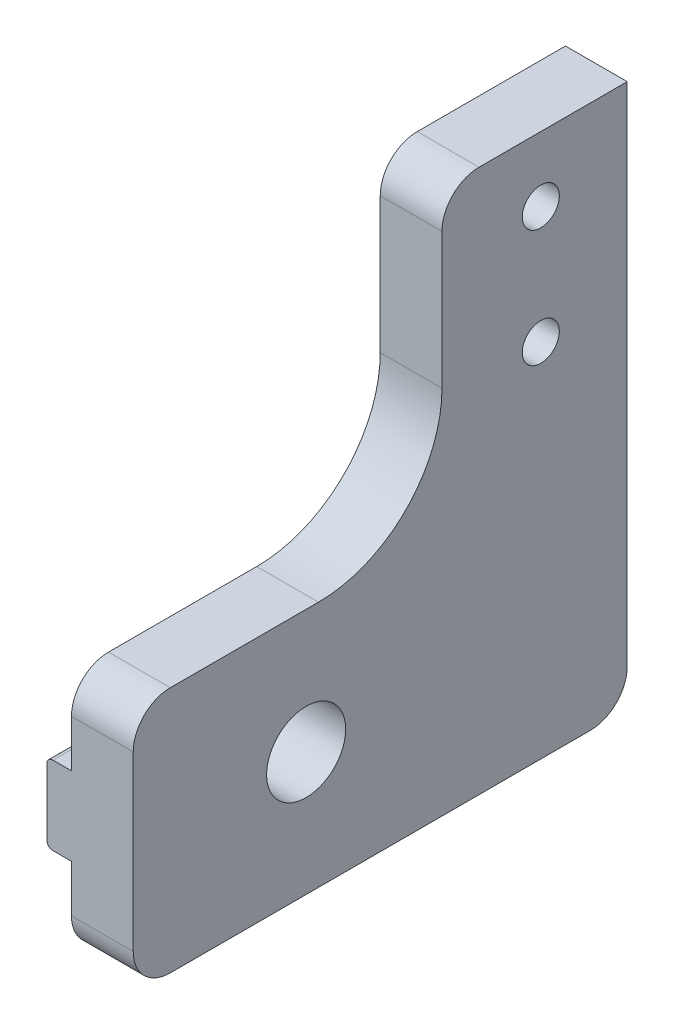
ISO-10303-21;
HEADER;
FILE_DESCRIPTION(('STEP AP214'),'2;1');
FILE_NAME('part.step','',(''),(''),'','','');
FILE_SCHEMA(('AUTOMOTIVE_DESIGN { 1 0 10303 214 1 1 1 1 }'));
ENDSEC;
DATA;
#1=APPLICATION_CONTEXT('core data for automotive mechanical design processes');
#2=APPLICATION_PROTOCOL_DEFINITION('international standard','automotive_design',2000,#1);
#3=PRODUCT_CONTEXT('',#1,'mechanical');
#4=PRODUCT('Part','Part','',(#3));
#5=PRODUCT_RELATED_PRODUCT_CATEGORY('part','',(#4));
#6=PRODUCT_DEFINITION_FORMATION('','',#4);
#7=PRODUCT_DEFINITION_CONTEXT('part definition',#1,'design');
#8=PRODUCT_DEFINITION('design','',#6,#7);
#9=PRODUCT_DEFINITION_SHAPE('','',#8);
#10=(LENGTH_UNIT() NAMED_UNIT(*) SI_UNIT(.MILLI.,.METRE.));
#11=(NAMED_UNIT(*) PLANE_ANGLE_UNIT() SI_UNIT($,.RADIAN.));
#12=(NAMED_UNIT(*) SI_UNIT($,.STERADIAN.) SOLID_ANGLE_UNIT());
#13=UNCERTAINTY_MEASURE_WITH_UNIT(LENGTH_MEASURE(1.E-05),#10,'distance_accuracy_value','');
#14=(GEOMETRIC_REPRESENTATION_CONTEXT(3) GLOBAL_UNCERTAINTY_ASSIGNED_CONTEXT((#13)) GLOBAL_UNIT_ASSIGNED_CONTEXT((#10,
#11,#12)) REPRESENTATION_CONTEXT('',''));
#15=CARTESIAN_POINT('',(0.,0.,0.));
#16=DIRECTION('',(0.,0.,1.));
#17=DIRECTION('',(1.,0.,0.));
#18=AXIS2_PLACEMENT_3D('',#15,#16,#17);
#19=CARTESIAN_POINT('',(-2.,6.825,-40.));
#20=DIRECTION('',(0.,1.,0.));
#21=DIRECTION('',(0.,0.,1.));
#22=AXIS2_PLACEMENT_3D('',#19,#20,#21);
#23=PLANE('',#22);
#24=DIRECTION('',(0.,0.,1.));
#25=VECTOR('',#24,1.);
#26=CARTESIAN_POINT('',(-1.5,6.825,-40.));
#27=LINE('',#26,#25);
#28=CARTESIAN_POINT('',(-1.5,6.825,0.));
#29=VERTEX_POINT('',#28);
#30=CARTESIAN_POINT('',(-1.5,6.825,-13.597588320249));
#31=VERTEX_POINT('',#30);
#32=EDGE_CURVE('E236',#29,#31,#27,.F.);
#33=ORIENTED_EDGE('',*,*,#32,.T.);
#34=DIRECTION('',(1.,0.,0.));
#35=VECTOR('',#34,1.);
#36=CARTESIAN_POINT('',(-2.,6.825,-13.597588320249));
#37=LINE('',#36,#35);
#38=CARTESIAN_POINT('',(0.,6.825,-13.597588320249));
#39=VERTEX_POINT('',#38);
#40=EDGE_CURVE('E335',#31,#39,#37,.T.);
#41=ORIENTED_EDGE('',*,*,#40,.T.);
#42=DIRECTION('',(0.,0.,1.));
#43=VECTOR('',#42,1.);
#44=CARTESIAN_POINT('',(0.,6.825,-40.));
#45=LINE('',#44,#43);
#46=CARTESIAN_POINT('',(0.,6.825,0.));
#47=VERTEX_POINT('',#46);
#48=EDGE_CURVE('E334',#39,#47,#45,.T.);
#49=ORIENTED_EDGE('',*,*,#48,.T.);
#50=DIRECTION('',(1.,0.,0.));
#51=VECTOR('',#50,1.);
#52=CARTESIAN_POINT('',(-2.,6.825,0.));
#53=LINE('',#52,#51);
#54=EDGE_CURVE('E354',#29,#47,#53,.T.);
#55=ORIENTED_EDGE('',*,*,#54,.F.);
#56=EDGE_LOOP('',(#33,#41,#49,#55));
#57=FACE_BOUND('',#56,.T.);
#58=ADVANCED_FACE('F37',(#57),#23,.F.);
#59=CARTESIAN_POINT('',(-2.,13.175,-40.));
#60=DIRECTION('',(0.,-1.,0.));
#61=DIRECTION('',(0.,0.,-1.));
#62=AXIS2_PLACEMENT_3D('',#59,#60,#61);
#63=PLANE('',#62);
#64=DIRECTION('',(0.,0.,-1.));
#65=VECTOR('',#64,1.);
#66=CARTESIAN_POINT('',(-1.5,13.175,-40.));
#67=LINE('',#66,#65);
#68=CARTESIAN_POINT('',(-1.5,13.175,-40.));
#69=VERTEX_POINT('',#68);
#70=CARTESIAN_POINT('',(-1.5,13.175,-14.402411679751));
#71=VERTEX_POINT('',#70);
#72=EDGE_CURVE('E243',#69,#71,#67,.F.);
#73=ORIENTED_EDGE('',*,*,#72,.T.);
#74=DIRECTION('',(1.,0.,0.));
#75=VECTOR('',#74,1.);
#76=CARTESIAN_POINT('',(-2.,13.175,-14.402411679751));
#77=LINE('',#76,#75);
#78=CARTESIAN_POINT('',(0.,13.175,-14.402411679751));
#79=VERTEX_POINT('',#78);
#80=EDGE_CURVE('E198',#71,#79,#77,.T.);
#81=ORIENTED_EDGE('',*,*,#80,.T.);
#82=DIRECTION('',(0.,0.,-1.));
#83=VECTOR('',#82,1.);
#84=CARTESIAN_POINT('',(0.,13.175,-40.));
#85=LINE('',#84,#83);
#86=CARTESIAN_POINT('',(0.,13.175,-40.));
#87=VERTEX_POINT('',#86);
#88=EDGE_CURVE('E346',#79,#87,#85,.T.);
#89=ORIENTED_EDGE('',*,*,#88,.T.);
#90=DIRECTION('',(1.,0.,0.));
#91=VECTOR('',#90,1.);
#92=CARTESIAN_POINT('',(-2.,13.175,-40.));
#93=LINE('',#92,#91);
#94=EDGE_CURVE('E342',#69,#87,#93,.T.);
#95=ORIENTED_EDGE('',*,*,#94,.F.);
#96=EDGE_LOOP('',(#73,#81,#89,#95));
#97=FACE_BOUND('',#96,.T.);
#98=ADVANCED_FACE('F449',(#97),#63,.F.);
#99=CARTESIAN_POINT('',(-2.,0.,0.));
#100=DIRECTION('',(1.,0.,0.));
#101=DIRECTION('',(0.,0.,-1.));
#102=AXIS2_PLACEMENT_3D('',#99,#100,#101);
#103=PLANE('',#102);
#104=DIRECTION('',(0.,0.,-1.));
#105=VECTOR('',#104,1.);
#106=CARTESIAN_POINT('',(-2.,12.675,0.));
#107=LINE('',#106,#105);
#108=CARTESIAN_POINT('',(-2.,12.675,0.));
#109=VERTEX_POINT('',#108);
#110=CARTESIAN_POINT('',(-2.,12.675,-12.2430323964284));
#111=VERTEX_POINT('',#110);
#112=EDGE_CURVE('E220',#109,#111,#107,.T.);
#113=ORIENTED_EDGE('',*,*,#112,.T.);
#114=CARTESIAN_POINT('',(-2.,10.,-14.));
#115=DIRECTION('',(1.,0.,0.));
#116=DIRECTION('',(0.,0.,-1.));
#117=AXIS2_PLACEMENT_3D('',#114,#115,#116);
#118=CIRCLE('',#117,3.2004);
#119=CARTESIAN_POINT('',(-2.,7.325,-12.2430323964284));
#120=VERTEX_POINT('',#119);
#121=EDGE_CURVE('E214',#111,#120,#118,.T.);
#122=ORIENTED_EDGE('',*,*,#121,.T.);
#123=DIRECTION('',(0.,0.,1.));
#124=VECTOR('',#123,1.);
#125=CARTESIAN_POINT('',(-2.,7.325,0.));
#126=LINE('',#125,#124);
#127=CARTESIAN_POINT('',(-2.,7.325,0.));
#128=VERTEX_POINT('',#127);
#129=EDGE_CURVE('E224',#120,#128,#126,.T.);
#130=ORIENTED_EDGE('',*,*,#129,.T.);
#131=DIRECTION('',(0.,1.,0.));
#132=VECTOR('',#131,1.);
#133=CARTESIAN_POINT('',(-2.,6.825,0.));
#134=LINE('',#133,#132);
#135=EDGE_CURVE('E338',#128,#109,#134,.T.);
#136=ORIENTED_EDGE('',*,*,#135,.T.);
#137=EDGE_LOOP('',(#113,#122,#130,#136));
#138=FACE_BOUND('',#137,.T.);
#139=ADVANCED_FACE('F479',(#138),#103,.F.);
#140=CARTESIAN_POINT('',(-1.5,7.325,0.));
#141=DIRECTION('',(0.,0.,1.));
#142=DIRECTION('',(0.,-1.,0.));
#143=AXIS2_PLACEMENT_3D('',#140,#141,#142);
#144=CYLINDRICAL_SURFACE('',#143,0.5);
#145=CARTESIAN_POINT('',(-1.5,6.825,-13.597588320249));
#146=CARTESIAN_POINT('',(-1.50427664191402,6.82499814053139,-13.5976049597973));
#147=CARTESIAN_POINT('',(-1.50852658700402,6.82505476239598,-13.5971560866422));
#148=CARTESIAN_POINT('',(-1.51679500239354,6.82526586793275,-13.5954948382761));
#149=CARTESIAN_POINT('',(-1.52081628697154,6.82541853972414,-13.5942966014562));
#150=CARTESIAN_POINT('',(-1.52995260437398,6.82587003464056,-13.5907776491562));
#151=CARTESIAN_POINT('',(-1.53496878522544,6.82620104849179,-13.5882127316332));
#152=CARTESIAN_POINT('',(-1.54457707865009,6.82696774443779,-13.5823451196413));
#153=CARTESIAN_POINT('',(-1.54916522864581,6.82740429143693,-13.579036345411));
#154=CARTESIAN_POINT('',(-1.56530407860007,6.82914003196233,-13.5660703252987));
#155=CARTESIAN_POINT('',(-1.5756895717888,6.8306625889816,-13.5550371577924));
#156=CARTESIAN_POINT('',(-1.59497632086415,6.83400847216192,-13.5318100903644));
#157=CARTESIAN_POINT('',(-1.60386810122129,6.83583358253153,-13.5196094980821));
#158=CARTESIAN_POINT('',(-1.63096049207533,6.8420698598244,-13.4796124920958));
#159=CARTESIAN_POINT('',(-1.64746332067128,6.84694654550404,-13.4507430474807));
#160=CARTESIAN_POINT('',(-1.67859760121378,6.85770472544215,-13.3921808481114));
#161=CARTESIAN_POINT('',(-1.69322351906558,6.86358907689914,-13.3624859591236));
#162=CARTESIAN_POINT('',(-1.72124956622155,6.876349349685,-13.3026471084432));
#163=CARTESIAN_POINT('',(-1.7346472498042,6.88322718206305,-13.2725023840206));
#164=CARTESIAN_POINT('',(-1.76047271962536,6.89794819834407,-13.2120897546067));
#165=CARTESIAN_POINT('',(-1.77290169292587,6.905790169402,-13.1818220497651));
#166=CARTESIAN_POINT('',(-1.80908226307331,6.93087327135872,-13.0905993667109));
#167=CARTESIAN_POINT('',(-1.83158226871623,6.94960391800914,-13.0295454297643));
#168=CARTESIAN_POINT('',(-1.87333789944561,6.99110943341728,-12.907620120899));
#169=CARTESIAN_POINT('',(-1.89258982470967,7.01388885423065,-12.8467490337195));
#170=CARTESIAN_POINT('',(-1.92717787078553,7.06341493508024,-12.725925199187));
#171=CARTESIAN_POINT('',(-1.94253554406723,7.09013840420448,-12.6659692037151));
#172=CARTESIAN_POINT('',(-1.96855570650107,7.14765687033618,-12.5470544128651));
#173=CARTESIAN_POINT('',(-1.97922454264293,7.17844628959266,-12.4880943739921));
#174=CARTESIAN_POINT('',(-1.99104279638496,7.22902789270643,-12.3982538736311));
#175=CARTESIAN_POINT('',(-1.99431439978301,7.24741453586647,-12.3668562023655));
#176=CARTESIAN_POINT('',(-1.99878999296379,7.28535209819371,-12.3045404901));
#177=CARTESIAN_POINT('',(-1.99998991453283,7.30490523034714,-12.2736235106976));
#178=CARTESIAN_POINT('',(-2.,7.325,-12.2430323964284));
#179=B_SPLINE_CURVE_WITH_KNOTS('',3,(#145,#146,#147,#148,#149,#150,#151,#152,#153,#154,#155,
#156,#157,#158,#159,#160,#161,#162,#163,#164,#165,#166,#167,#168,#169,#170,#171,#172,#173,#174,
#175,#176,#177,#178),.UNSPECIFIED.,.F.,.F.,(4,2,2,2,2,2,2,2,2,2,2,2,2,2,2,2,4),(0.,
0.0127634346770811,0.0252930369842646,0.0421271138064015,0.0591041341208309,0.104426226618348,
0.150025775116456,0.250587203769936,0.351438640484329,0.452486723255077,0.55340896808811,
0.756325943303772,0.959472519028141,1.16146896849709,1.36319113926759,1.47271524417688,
1.58245418073128),.UNSPECIFIED.);
#180=EDGE_CURVE('E327',#31,#120,#179,.T.);
#181=ORIENTED_EDGE('',*,*,#180,.F.);
#182=ORIENTED_EDGE('',*,*,#32,.F.);
#183=CARTESIAN_POINT('',(-1.5,7.325,0.));
#184=DIRECTION('',(0.,0.,-1.));
#185=DIRECTION('',(-1.,0.,0.));
#186=AXIS2_PLACEMENT_3D('',#183,#184,#185);
#187=CIRCLE('',#186,0.5);
#188=EDGE_CURVE('E233',#128,#29,#187,.F.);
#189=ORIENTED_EDGE('',*,*,#188,.F.);
#190=ORIENTED_EDGE('',*,*,#129,.F.);
#191=EDGE_LOOP('',(#181,#182,#189,#190));
#192=FACE_BOUND('',#191,.T.);
#193=ADVANCED_FACE('F323',(#192),#144,.T.);
#194=CARTESIAN_POINT('',(-1.5,12.675,0.));
#195=DIRECTION('',(0.,0.,-1.));
#196=DIRECTION('',(-1.,0.,0.));
#197=AXIS2_PLACEMENT_3D('',#194,#195,#196);
#198=CYLINDRICAL_SURFACE('',#197,0.5);
#199=CARTESIAN_POINT('',(-1.5,13.175,-14.402411679751));
#200=CARTESIAN_POINT('',(-1.50427664191402,13.1750018594686,-14.4023950402028));
#201=CARTESIAN_POINT('',(-1.50852658700402,13.174945237604,-14.4028439133578));
#202=CARTESIAN_POINT('',(-1.51679500239354,13.1747341320672,-14.4045051617239));
#203=CARTESIAN_POINT('',(-1.52081628697154,13.1745814602759,-14.4057033985438));
#204=CARTESIAN_POINT('',(-1.52995260437398,13.1741299653594,-14.4092223508438));
#205=CARTESIAN_POINT('',(-1.53496878522544,13.1737989515082,-14.4117872683668));
#206=CARTESIAN_POINT('',(-1.54457707865009,13.1730322555622,-14.4176548803587));
#207=CARTESIAN_POINT('',(-1.54916522864581,13.1725957085631,-14.420963654589));
#208=CARTESIAN_POINT('',(-1.56530407860007,13.1708599680377,-14.4339296747013));
#209=CARTESIAN_POINT('',(-1.5756895717888,13.1693374110184,-14.4449628422076));
#210=CARTESIAN_POINT('',(-1.59497632086415,13.1659915278381,-14.4681899096356));
#211=CARTESIAN_POINT('',(-1.6038681012213,13.1641664174685,-14.4803905019179));
#212=CARTESIAN_POINT('',(-1.63096049207534,13.1579301401756,-14.5203875079042));
#213=CARTESIAN_POINT('',(-1.64746332067129,13.153053454496,-14.5492569525193));
#214=CARTESIAN_POINT('',(-1.67859760121379,13.1422952745579,-14.6078191518886));
#215=CARTESIAN_POINT('',(-1.69322351906559,13.1364109231009,-14.6375140408764));
#216=CARTESIAN_POINT('',(-1.72124956622156,13.123650650315,-14.6973528915568));
#217=CARTESIAN_POINT('',(-1.73464724980421,13.1167728179369,-14.7274976159794));
#218=CARTESIAN_POINT('',(-1.76047271962537,13.1020518016559,-14.7879102453933));
#219=CARTESIAN_POINT('',(-1.77290169292588,13.094209830598,-14.818177950235));
#220=CARTESIAN_POINT('',(-1.80908226307332,13.0691267286413,-14.9094006332891));
#221=CARTESIAN_POINT('',(-1.83158226871624,13.0503960819908,-14.9704545702358));
#222=CARTESIAN_POINT('',(-1.87333789944562,13.0088905665827,-15.0923798791011));
#223=CARTESIAN_POINT('',(-1.89258982470968,12.9861111457693,-15.1532509662806));
#224=CARTESIAN_POINT('',(-1.92717787078554,12.9365850649197,-15.2740748008131));
#225=CARTESIAN_POINT('',(-1.94253554406725,12.9098615957955,-15.3340307962849));
#226=CARTESIAN_POINT('',(-1.96855570650108,12.8523431296638,-15.4529455871349));
#227=CARTESIAN_POINT('',(-1.97922454264294,12.8215537104073,-15.511905626008));
#228=CARTESIAN_POINT('',(-1.99104279638496,12.7709721072935,-15.601746126369));
#229=CARTESIAN_POINT('',(-1.99431439978301,12.7525854641335,-15.6331437976345));
#230=CARTESIAN_POINT('',(-1.99878999296379,12.7146479018063,-15.6954595099));
#231=CARTESIAN_POINT('',(-1.99998991453283,12.6950947696529,-15.7263764893025));
#232=CARTESIAN_POINT('',(-2.,12.675,-15.7569676035716));
#233=B_SPLINE_CURVE_WITH_KNOTS('',3,(#199,#200,#201,#202,#203,#204,#205,#206,#207,#208,#209,
#210,#211,#212,#213,#214,#215,#216,#217,#218,#219,#220,#221,#222,#223,#224,#225,#226,#227,#228,
#229,#230,#231,#232),.UNSPECIFIED.,.F.,.F.,(4,2,2,2,2,2,2,2,2,2,2,2,2,2,2,2,4),(0.,
0.0127634346770817,0.0252930369842659,0.0421271138064035,0.0591041341208326,0.104426226618351,
0.150025775116463,0.250587203769946,0.351438640484343,0.452486723255095,0.553408968088133,
0.756325943303803,0.959472519028178,1.16146896849713,1.36319113926764,1.4727152441769,
1.58245418073126),.UNSPECIFIED.);
#234=CARTESIAN_POINT('',(-2.,12.675,-15.7569676035716));
#235=VERTEX_POINT('',#234);
#236=EDGE_CURVE('E191',#71,#235,#233,.T.);
#237=ORIENTED_EDGE('',*,*,#236,.F.);
#238=ORIENTED_EDGE('',*,*,#72,.F.);
#239=CARTESIAN_POINT('',(-1.5,12.675,-40.));
#240=DIRECTION('',(0.,0.,1.));
#241=DIRECTION('',(0.,-1.,0.));
#242=AXIS2_PLACEMENT_3D('',#239,#240,#241);
#243=CIRCLE('',#242,0.5);
#244=CARTESIAN_POINT('',(-2.,12.675,-40.));
#245=VERTEX_POINT('',#244);
#246=EDGE_CURVE('E218',#245,#69,#243,.F.);
#247=ORIENTED_EDGE('',*,*,#246,.F.);
#248=EDGE_CURVE('E210',#235,#245,#107,.T.);
#249=ORIENTED_EDGE('',*,*,#248,.F.);
#250=EDGE_LOOP('',(#237,#238,#247,#249));
#251=FACE_BOUND('',#250,.T.);
#252=ADVANCED_FACE('F217',(#251),#198,.T.);
#253=CARTESIAN_POINT('',(0.,0.,0.));
#254=DIRECTION('',(-1.,0.,0.));
#255=DIRECTION('',(0.,0.,1.));
#256=AXIS2_PLACEMENT_3D('',#253,#254,#255);
#257=PLANE('',#256);
#258=CARTESIAN_POINT('',(0.,10.,-14.));
#259=DIRECTION('',(-1.,0.,0.));
#260=DIRECTION('',(0.,0.,1.));
#261=AXIS2_PLACEMENT_3D('',#258,#259,#260);
#262=CIRCLE('',#261,3.2004);
#263=CARTESIAN_POINT('',(0.,13.175,-13.597588320249));
#264=VERTEX_POINT('',#263);
#265=EDGE_CURVE('E446',#264,#79,#262,.T.);
#266=ORIENTED_EDGE('',*,*,#265,.F.);
#267=CARTESIAN_POINT('',(0.,13.175,0.));
#268=VERTEX_POINT('',#267);
#269=EDGE_CURVE('E339',#268,#264,#85,.T.);
#270=ORIENTED_EDGE('',*,*,#269,.F.);
#271=DIRECTION('',(0.,-1.,0.));
#272=VECTOR('',#271,1.);
#273=CARTESIAN_POINT('',(0.,0.,0.));
#274=LINE('',#273,#272);
#275=CARTESIAN_POINT('',(0.,17.,0.));
#276=VERTEX_POINT('',#275);
#277=EDGE_CURVE('E377',#276,#268,#274,.T.);
#278=ORIENTED_EDGE('',*,*,#277,.F.);
#279=CARTESIAN_POINT('',(0.,17.,-3.));
#280=DIRECTION('',(-1.,0.,0.));
#281=DIRECTION('',(0.,0.,1.));
#282=AXIS2_PLACEMENT_3D('',#279,#280,#281);
#283=CIRCLE('',#282,3.);
#284=CARTESIAN_POINT('',(0.,20.,-3.));
#285=VERTEX_POINT('',#284);
#286=EDGE_CURVE('E248',#276,#285,#283,.T.);
#287=ORIENTED_EDGE('',*,*,#286,.T.);
#288=DIRECTION('',(0.,0.,1.));
#289=VECTOR('',#288,1.);
#290=CARTESIAN_POINT('',(0.,20.,0.));
#291=LINE('',#290,#289);
#292=CARTESIAN_POINT('',(0.,20.,-15.));
#293=VERTEX_POINT('',#292);
#294=EDGE_CURVE('E398',#293,#285,#291,.T.);
#295=ORIENTED_EDGE('',*,*,#294,.F.);
#296=CARTESIAN_POINT('',(0.,30.,-15.));
#297=DIRECTION('',(-1.,0.,0.));
#298=DIRECTION('',(0.,0.,1.));
#299=AXIS2_PLACEMENT_3D('',#296,#297,#298);
#300=CIRCLE('',#299,10.);
#301=CARTESIAN_POINT('',(0.,30.,-25.));
#302=VERTEX_POINT('',#301);
#303=EDGE_CURVE('E45',#293,#302,#300,.F.);
#304=ORIENTED_EDGE('',*,*,#303,.T.);
#305=DIRECTION('',(0.,-1.,0.));
#306=VECTOR('',#305,1.);
#307=CARTESIAN_POINT('',(0.,20.,-25.));
#308=LINE('',#307,#306);
#309=CARTESIAN_POINT('',(0.,41.,-25.));
#310=VERTEX_POINT('',#309);
#311=EDGE_CURVE('E396',#310,#302,#308,.T.);
#312=ORIENTED_EDGE('',*,*,#311,.F.);
#313=CARTESIAN_POINT('',(0.,41.,-28.));
#314=DIRECTION('',(-1.,0.,0.));
#315=DIRECTION('',(0.,0.,1.));
#316=AXIS2_PLACEMENT_3D('',#313,#314,#315);
#317=CIRCLE('',#316,3.);
#318=CARTESIAN_POINT('',(0.,44.,-28.));
#319=VERTEX_POINT('',#318);
#320=EDGE_CURVE('E251',#310,#319,#317,.T.);
#321=ORIENTED_EDGE('',*,*,#320,.T.);
#322=DIRECTION('',(0.,0.,1.));
#323=VECTOR('',#322,1.);
#324=CARTESIAN_POINT('',(0.,44.,-25.));
#325=LINE('',#324,#323);
#326=CARTESIAN_POINT('',(0.,44.,-40.));
#327=VERTEX_POINT('',#326);
#328=EDGE_CURVE('E393',#327,#319,#325,.T.);
#329=ORIENTED_EDGE('',*,*,#328,.F.);
#330=DIRECTION('',(0.,1.,0.));
#331=VECTOR('',#330,1.);
#332=CARTESIAN_POINT('',(0.,44.,-40.));
#333=LINE('',#332,#331);
#334=EDGE_CURVE('E390',#87,#327,#333,.T.);
#335=ORIENTED_EDGE('',*,*,#334,.F.);
#336=ORIENTED_EDGE('',*,*,#88,.F.);
#337=EDGE_LOOP('',(#266,#270,#278,#287,#295,#304,#312,#321,#329,#335,#336));
#338=FACE_BOUND('',#337,.T.);
#339=CARTESIAN_POINT('',(0.,38.75,-33.));
#340=DIRECTION('',(1.,0.,0.));
#341=DIRECTION('',(0.,0.,-1.));
#342=AXIS2_PLACEMENT_3D('',#339,#340,#341);
#343=CIRCLE('',#342,1.5);
#344=CARTESIAN_POINT('',(0.,38.75,-34.5));
#345=VERTEX_POINT('',#344);
#346=EDGE_CURVE('E364',#345,#345,#343,.T.);
#347=ORIENTED_EDGE('',*,*,#346,.T.);
#348=EDGE_LOOP('',(#347));
#349=FACE_BOUND('',#348,.T.);
#350=CARTESIAN_POINT('',(0.,29.25,-33.));
#351=DIRECTION('',(1.,0.,0.));
#352=DIRECTION('',(0.,0.,-1.));
#353=AXIS2_PLACEMENT_3D('',#350,#351,#352);
#354=CIRCLE('',#353,1.5);
#355=CARTESIAN_POINT('',(0.,29.25,-34.5));
#356=VERTEX_POINT('',#355);
#357=EDGE_CURVE('E360',#356,#356,#354,.T.);
#358=ORIENTED_EDGE('',*,*,#357,.T.);
#359=EDGE_LOOP('',(#358));
#360=FACE_BOUND('',#359,.T.);
#361=ADVANCED_FACE('F442',(#338,#349,#360),#257,.T.);
#362=CARTESIAN_POINT('',(5.,0.,0.));
#363=DIRECTION('',(-1.,0.,0.));
#364=DIRECTION('',(0.,0.,1.));
#365=AXIS2_PLACEMENT_3D('',#362,#363,#364);
#366=PLANE('',#365);
#367=CARTESIAN_POINT('',(5.,10.,-14.));
#368=DIRECTION('',(1.,0.,0.));
#369=DIRECTION('',(0.,0.,-1.));
#370=AXIS2_PLACEMENT_3D('',#367,#368,#369);
#371=CIRCLE('',#370,3.2004);
#372=CARTESIAN_POINT('',(5.,10.,-17.2004));
#373=VERTEX_POINT('',#372);
#374=EDGE_CURVE('E215',#373,#373,#371,.T.);
#375=ORIENTED_EDGE('',*,*,#374,.F.);
#376=EDGE_LOOP('',(#375));
#377=FACE_BOUND('',#376,.T.);
#378=DIRECTION('',(0.,0.,1.));
#379=VECTOR('',#378,1.);
#380=CARTESIAN_POINT('',(5.,44.,-25.));
#381=LINE('',#380,#379);
#382=CARTESIAN_POINT('',(5.,44.,-40.));
#383=VERTEX_POINT('',#382);
#384=CARTESIAN_POINT('',(5.,44.,-28.));
#385=VERTEX_POINT('',#384);
#386=EDGE_CURVE('E379',#383,#385,#381,.T.);
#387=ORIENTED_EDGE('',*,*,#386,.T.);
#388=CARTESIAN_POINT('',(5.,41.,-28.));
#389=DIRECTION('',(-1.,0.,0.));
#390=DIRECTION('',(0.,0.,1.));
#391=AXIS2_PLACEMENT_3D('',#388,#389,#390);
#392=CIRCLE('',#391,3.);
#393=CARTESIAN_POINT('',(5.,41.,-25.));
#394=VERTEX_POINT('',#393);
#395=EDGE_CURVE('E261',#385,#394,#392,.F.);
#396=ORIENTED_EDGE('',*,*,#395,.T.);
#397=DIRECTION('',(0.,-1.,0.));
#398=VECTOR('',#397,1.);
#399=CARTESIAN_POINT('',(5.,20.,-25.));
#400=LINE('',#399,#398);
#401=CARTESIAN_POINT('',(5.,30.,-25.));
#402=VERTEX_POINT('',#401);
#403=EDGE_CURVE('E382',#394,#402,#400,.T.);
#404=ORIENTED_EDGE('',*,*,#403,.T.);
#405=CARTESIAN_POINT('',(5.,30.,-15.));
#406=DIRECTION('',(-1.,0.,0.));
#407=DIRECTION('',(0.,0.,1.));
#408=AXIS2_PLACEMENT_3D('',#405,#406,#407);
#409=CIRCLE('',#408,10.);
#410=CARTESIAN_POINT('',(5.,20.,-15.));
#411=VERTEX_POINT('',#410);
#412=EDGE_CURVE('E11',#402,#411,#409,.T.);
#413=ORIENTED_EDGE('',*,*,#412,.T.);
#414=DIRECTION('',(0.,0.,1.));
#415=VECTOR('',#414,1.);
#416=CARTESIAN_POINT('',(5.,20.,0.));
#417=LINE('',#416,#415);
#418=CARTESIAN_POINT('',(5.,20.,-3.));
#419=VERTEX_POINT('',#418);
#420=EDGE_CURVE('E384',#411,#419,#417,.T.);
#421=ORIENTED_EDGE('',*,*,#420,.T.);
#422=CARTESIAN_POINT('',(5.,17.,-3.));
#423=DIRECTION('',(-1.,0.,0.));
#424=DIRECTION('',(0.,0.,1.));
#425=AXIS2_PLACEMENT_3D('',#422,#423,#424);
#426=CIRCLE('',#425,3.);
#427=CARTESIAN_POINT('',(5.,17.,0.));
#428=VERTEX_POINT('',#427);
#429=EDGE_CURVE('E259',#419,#428,#426,.F.);
#430=ORIENTED_EDGE('',*,*,#429,.T.);
#431=DIRECTION('',(0.,-1.,0.));
#432=VECTOR('',#431,1.);
#433=CARTESIAN_POINT('',(5.,0.,0.));
#434=LINE('',#433,#432);
#435=CARTESIAN_POINT('',(5.,3.,0.));
#436=VERTEX_POINT('',#435);
#437=EDGE_CURVE('E226',#428,#436,#434,.T.);
#438=ORIENTED_EDGE('',*,*,#437,.T.);
#439=CARTESIAN_POINT('',(5.,3.,-3.));
#440=DIRECTION('',(-1.,0.,0.));
#441=DIRECTION('',(0.,0.,1.));
#442=AXIS2_PLACEMENT_3D('',#439,#440,#441);
#443=CIRCLE('',#442,3.);
#444=CARTESIAN_POINT('',(5.,0.,-3.));
#445=VERTEX_POINT('',#444);
#446=EDGE_CURVE('E257',#436,#445,#443,.F.);
#447=ORIENTED_EDGE('',*,*,#446,.T.);
#448=DIRECTION('',(0.,0.,-1.));
#449=VECTOR('',#448,1.);
#450=CARTESIAN_POINT('',(5.,0.,-40.));
#451=LINE('',#450,#449);
#452=CARTESIAN_POINT('',(5.,0.,-37.));
#453=VERTEX_POINT('',#452);
#454=EDGE_CURVE('E373',#445,#453,#451,.T.);
#455=ORIENTED_EDGE('',*,*,#454,.T.);
#456=CARTESIAN_POINT('',(5.,3.,-37.));
#457=DIRECTION('',(-1.,0.,0.));
#458=DIRECTION('',(0.,0.,1.));
#459=AXIS2_PLACEMENT_3D('',#456,#457,#458);
#460=CIRCLE('',#459,3.);
#461=CARTESIAN_POINT('',(5.,3.,-40.));
#462=VERTEX_POINT('',#461);
#463=EDGE_CURVE('E255',#453,#462,#460,.F.);
#464=ORIENTED_EDGE('',*,*,#463,.T.);
#465=DIRECTION('',(0.,1.,0.));
#466=VECTOR('',#465,1.);
#467=CARTESIAN_POINT('',(5.,44.,-40.));
#468=LINE('',#467,#466);
#469=EDGE_CURVE('E376',#462,#383,#468,.T.);
#470=ORIENTED_EDGE('',*,*,#469,.T.);
#471=EDGE_LOOP('',(#387,#396,#404,#413,#421,#430,#438,#447,#455,#464,#470));
#472=FACE_BOUND('',#471,.T.);
#473=CARTESIAN_POINT('',(5.,38.75,-33.));
#474=DIRECTION('',(1.,0.,0.));
#475=DIRECTION('',(0.,0.,-1.));
#476=AXIS2_PLACEMENT_3D('',#473,#474,#475);
#477=CIRCLE('',#476,1.5);
#478=CARTESIAN_POINT('',(5.,38.75,-34.5));
#479=VERTEX_POINT('',#478);
#480=EDGE_CURVE('E367',#479,#479,#477,.T.);
#481=ORIENTED_EDGE('',*,*,#480,.F.);
#482=EDGE_LOOP('',(#481));
#483=FACE_BOUND('',#482,.T.);
#484=CARTESIAN_POINT('',(5.,29.25,-33.));
#485=DIRECTION('',(1.,0.,0.));
#486=DIRECTION('',(0.,0.,-1.));
#487=AXIS2_PLACEMENT_3D('',#484,#485,#486);
#488=CIRCLE('',#487,1.5);
#489=CARTESIAN_POINT('',(5.,29.25,-34.5));
#490=VERTEX_POINT('',#489);
#491=EDGE_CURVE('E361',#490,#490,#488,.T.);
#492=ORIENTED_EDGE('',*,*,#491,.F.);
#493=EDGE_LOOP('',(#492));
#494=FACE_BOUND('',#493,.T.);
#495=ADVANCED_FACE('F417',(#377,#472,#483,#494),#366,.F.);
#496=CARTESIAN_POINT('',(0.,10.,-14.));
#497=DIRECTION('',(-1.,0.,0.));
#498=DIRECTION('',(0.,0.,1.));
#499=AXIS2_PLACEMENT_3D('',#496,#497,#498);
#500=CIRCLE('',#499,3.2004);
#501=CARTESIAN_POINT('',(0.,6.825,-14.402411679751));
#502=VERTEX_POINT('',#501);
#503=EDGE_CURVE('E458',#502,#39,#500,.T.);
#504=ORIENTED_EDGE('',*,*,#503,.F.);
#505=CARTESIAN_POINT('',(0.,6.825,-40.));
#506=VERTEX_POINT('',#505);
#507=EDGE_CURVE('E343',#506,#502,#45,.T.);
#508=ORIENTED_EDGE('',*,*,#507,.F.);
#509=CARTESIAN_POINT('',(0.,3.,-40.));
#510=VERTEX_POINT('',#509);
#511=EDGE_CURVE('E391',#510,#506,#333,.T.);
#512=ORIENTED_EDGE('',*,*,#511,.F.);
#513=CARTESIAN_POINT('',(0.,3.,-37.));
#514=DIRECTION('',(-1.,0.,0.));
#515=DIRECTION('',(0.,0.,1.));
#516=AXIS2_PLACEMENT_3D('',#513,#514,#515);
#517=CIRCLE('',#516,3.);
#518=CARTESIAN_POINT('',(0.,0.,-37.));
#519=VERTEX_POINT('',#518);
#520=EDGE_CURVE('E276',#510,#519,#517,.T.);
#521=ORIENTED_EDGE('',*,*,#520,.T.);
#522=DIRECTION('',(0.,0.,-1.));
#523=VECTOR('',#522,1.);
#524=CARTESIAN_POINT('',(0.,0.,-40.));
#525=LINE('',#524,#523);
#526=CARTESIAN_POINT('',(0.,0.,-3.));
#527=VERTEX_POINT('',#526);
#528=EDGE_CURVE('E370',#527,#519,#525,.T.);
#529=ORIENTED_EDGE('',*,*,#528,.F.);
#530=CARTESIAN_POINT('',(0.,3.,-3.));
#531=DIRECTION('',(-1.,0.,0.));
#532=DIRECTION('',(0.,0.,1.));
#533=AXIS2_PLACEMENT_3D('',#530,#531,#532);
#534=CIRCLE('',#533,3.);
#535=CARTESIAN_POINT('',(0.,3.,0.));
#536=VERTEX_POINT('',#535);
#537=EDGE_CURVE('E278',#527,#536,#534,.T.);
#538=ORIENTED_EDGE('',*,*,#537,.T.);
#539=EDGE_CURVE('E399',#47,#536,#274,.T.);
#540=ORIENTED_EDGE('',*,*,#539,.F.);
#541=ORIENTED_EDGE('',*,*,#48,.F.);
#542=EDGE_LOOP('',(#504,#508,#512,#521,#529,#538,#540,#541));
#543=FACE_BOUND('',#542,.T.);
#544=ADVANCED_FACE('F463',(#543),#257,.T.);
#545=CARTESIAN_POINT('',(5.,0.,-40.));
#546=DIRECTION('',(0.,1.,0.));
#547=DIRECTION('',(0.,0.,1.));
#548=AXIS2_PLACEMENT_3D('',#545,#546,#547);
#549=PLANE('',#548);
#550=ORIENTED_EDGE('',*,*,#454,.F.);
#551=DIRECTION('',(-1.,0.,0.));
#552=VECTOR('',#551,1.);
#553=CARTESIAN_POINT('',(5.,0.,-3.));
#554=LINE('',#553,#552);
#555=EDGE_CURVE('E273',#445,#527,#554,.T.);
#556=ORIENTED_EDGE('',*,*,#555,.T.);
#557=ORIENTED_EDGE('',*,*,#528,.T.);
#558=DIRECTION('',(-1.,0.,0.));
#559=VECTOR('',#558,1.);
#560=CARTESIAN_POINT('',(5.,0.,-37.));
#561=LINE('',#560,#559);
#562=EDGE_CURVE('E271',#519,#453,#561,.F.);
#563=ORIENTED_EDGE('',*,*,#562,.T.);
#564=EDGE_LOOP('',(#550,#556,#557,#563));
#565=FACE_BOUND('',#564,.T.);
#566=ADVANCED_FACE('F324',(#565),#549,.F.);
#567=CARTESIAN_POINT('',(5.,44.,-40.));
#568=DIRECTION('',(0.,0.,1.));
#569=DIRECTION('',(0.,-1.,0.));
#570=AXIS2_PLACEMENT_3D('',#567,#568,#569);
#571=PLANE('',#570);
#572=ORIENTED_EDGE('',*,*,#469,.F.);
#573=DIRECTION('',(-1.,0.,0.));
#574=VECTOR('',#573,1.);
#575=CARTESIAN_POINT('',(5.,3.,-40.));
#576=LINE('',#575,#574);
#577=EDGE_CURVE('E280',#462,#510,#576,.T.);
#578=ORIENTED_EDGE('',*,*,#577,.T.);
#579=ORIENTED_EDGE('',*,*,#511,.T.);
#580=DIRECTION('',(1.,0.,0.));
#581=VECTOR('',#580,1.);
#582=CARTESIAN_POINT('',(-2.,6.825,-40.));
#583=LINE('',#582,#581);
#584=CARTESIAN_POINT('',(-1.5,6.825,-40.));
#585=VERTEX_POINT('',#584);
#586=EDGE_CURVE('E357',#585,#506,#583,.T.);
#587=ORIENTED_EDGE('',*,*,#586,.F.);
#588=CARTESIAN_POINT('',(-1.5,7.325,-40.));
#589=DIRECTION('',(0.,0.,1.));
#590=DIRECTION('',(0.,-1.,0.));
#591=AXIS2_PLACEMENT_3D('',#588,#589,#590);
#592=CIRCLE('',#591,0.5);
#593=CARTESIAN_POINT('',(-2.,7.325,-40.));
#594=VERTEX_POINT('',#593);
#595=EDGE_CURVE('E240',#585,#594,#592,.F.);
#596=ORIENTED_EDGE('',*,*,#595,.T.);
#597=DIRECTION('',(0.,-1.,0.));
#598=VECTOR('',#597,1.);
#599=CARTESIAN_POINT('',(-2.,6.825,-40.));
#600=LINE('',#599,#598);
#601=EDGE_CURVE('E336',#245,#594,#600,.T.);
#602=ORIENTED_EDGE('',*,*,#601,.F.);
#603=ORIENTED_EDGE('',*,*,#246,.T.);
#604=ORIENTED_EDGE('',*,*,#94,.T.);
#605=ORIENTED_EDGE('',*,*,#334,.T.);
#606=DIRECTION('',(-1.,0.,0.));
#607=VECTOR('',#606,1.);
#608=CARTESIAN_POINT('',(5.,44.,-40.));
#609=LINE('',#608,#607);
#610=EDGE_CURVE('E221',#383,#327,#609,.T.);
#611=ORIENTED_EDGE('',*,*,#610,.F.);
#612=EDGE_LOOP('',(#572,#578,#579,#587,#596,#602,#603,#604,#605,#611));
#613=FACE_BOUND('',#612,.T.);
#614=ADVANCED_FACE('F428',(#613),#571,.F.);
#615=CARTESIAN_POINT('',(5.,44.,-25.));
#616=DIRECTION('',(0.,-1.,0.));
#617=DIRECTION('',(0.,0.,-1.));
#618=AXIS2_PLACEMENT_3D('',#615,#616,#617);
#619=PLANE('',#618);
#620=ORIENTED_EDGE('',*,*,#328,.T.);
#621=DIRECTION('',(-1.,0.,0.));
#622=VECTOR('',#621,1.);
#623=CARTESIAN_POINT('',(5.,44.,-28.));
#624=LINE('',#623,#622);
#625=EDGE_CURVE('E253',#319,#385,#624,.F.);
#626=ORIENTED_EDGE('',*,*,#625,.T.);
#627=ORIENTED_EDGE('',*,*,#386,.F.);
#628=ORIENTED_EDGE('',*,*,#610,.T.);
#629=EDGE_LOOP('',(#620,#626,#627,#628));
#630=FACE_BOUND('',#629,.T.);
#631=ADVANCED_FACE('F434',(#630),#619,.F.);
#632=CARTESIAN_POINT('',(5.,20.,-25.));
#633=DIRECTION('',(0.,0.,-1.));
#634=DIRECTION('',(-1.,0.,0.));
#635=AXIS2_PLACEMENT_3D('',#632,#633,#634);
#636=PLANE('',#635);
#637=ORIENTED_EDGE('',*,*,#311,.T.);
#638=DIRECTION('',(-1.,0.,0.));
#639=VECTOR('',#638,1.);
#640=CARTESIAN_POINT('',(5.,30.,-25.));
#641=LINE('',#640,#639);
#642=EDGE_CURVE('E58',#302,#402,#641,.F.);
#643=ORIENTED_EDGE('',*,*,#642,.T.);
#644=ORIENTED_EDGE('',*,*,#403,.F.);
#645=DIRECTION('',(-1.,0.,0.));
#646=VECTOR('',#645,1.);
#647=CARTESIAN_POINT('',(5.,41.,-25.));
#648=LINE('',#647,#646);
#649=EDGE_CURVE('E245',#394,#310,#648,.T.);
#650=ORIENTED_EDGE('',*,*,#649,.T.);
#651=EDGE_LOOP('',(#637,#643,#644,#650));
#652=FACE_BOUND('',#651,.T.);
#653=ADVANCED_FACE('F440',(#652),#636,.F.);
#654=CARTESIAN_POINT('',(5.,20.,0.));
#655=DIRECTION('',(0.,-1.,0.));
#656=DIRECTION('',(0.,0.,-1.));
#657=AXIS2_PLACEMENT_3D('',#654,#655,#656);
#658=PLANE('',#657);
#659=ORIENTED_EDGE('',*,*,#420,.F.);
#660=DIRECTION('',(-1.,0.,0.));
#661=VECTOR('',#660,1.);
#662=CARTESIAN_POINT('',(0.,20.,-15.));
#663=LINE('',#662,#661);
#664=EDGE_CURVE('E203',#411,#293,#663,.T.);
#665=ORIENTED_EDGE('',*,*,#664,.T.);
#666=ORIENTED_EDGE('',*,*,#294,.T.);
#667=DIRECTION('',(-1.,0.,0.));
#668=VECTOR('',#667,1.);
#669=CARTESIAN_POINT('',(5.,20.,-3.));
#670=LINE('',#669,#668);
#671=EDGE_CURVE('E268',#285,#419,#670,.F.);
#672=ORIENTED_EDGE('',*,*,#671,.T.);
#673=EDGE_LOOP('',(#659,#665,#666,#672));
#674=FACE_BOUND('',#673,.T.);
#675=ADVANCED_FACE('F504',(#674),#658,.F.);
#676=CARTESIAN_POINT('',(5.,0.,0.));
#677=DIRECTION('',(0.,0.,-1.));
#678=DIRECTION('',(-1.,0.,0.));
#679=AXIS2_PLACEMENT_3D('',#676,#677,#678);
#680=PLANE('',#679);
#681=ORIENTED_EDGE('',*,*,#437,.F.);
#682=DIRECTION('',(-1.,0.,0.));
#683=VECTOR('',#682,1.);
#684=CARTESIAN_POINT('',(5.,17.,0.));
#685=LINE('',#684,#683);
#686=EDGE_CURVE('E265',#428,#276,#685,.T.);
#687=ORIENTED_EDGE('',*,*,#686,.T.);
#688=ORIENTED_EDGE('',*,*,#277,.T.);
#689=DIRECTION('',(1.,0.,0.));
#690=VECTOR('',#689,1.);
#691=CARTESIAN_POINT('',(-2.,13.175,0.));
#692=LINE('',#691,#690);
#693=CARTESIAN_POINT('',(-1.5,13.175,0.));
#694=VERTEX_POINT('',#693);
#695=EDGE_CURVE('E351',#694,#268,#692,.T.);
#696=ORIENTED_EDGE('',*,*,#695,.F.);
#697=CARTESIAN_POINT('',(-1.5,12.675,0.));
#698=DIRECTION('',(0.,0.,-1.));
#699=DIRECTION('',(-1.,0.,0.));
#700=AXIS2_PLACEMENT_3D('',#697,#698,#699);
#701=CIRCLE('',#700,0.5);
#702=EDGE_CURVE('E231',#694,#109,#701,.F.);
#703=ORIENTED_EDGE('',*,*,#702,.T.);
#704=ORIENTED_EDGE('',*,*,#135,.F.);
#705=ORIENTED_EDGE('',*,*,#188,.T.);
#706=ORIENTED_EDGE('',*,*,#54,.T.);
#707=ORIENTED_EDGE('',*,*,#539,.T.);
#708=DIRECTION('',(-1.,0.,0.));
#709=VECTOR('',#708,1.);
#710=CARTESIAN_POINT('',(5.,3.,0.));
#711=LINE('',#710,#709);
#712=EDGE_CURVE('E263',#536,#436,#711,.F.);
#713=ORIENTED_EDGE('',*,*,#712,.T.);
#714=EDGE_LOOP('',(#681,#687,#688,#696,#703,#704,#705,#706,#707,#713));
#715=FACE_BOUND('',#714,.T.);
#716=ADVANCED_FACE('F407',(#715),#680,.F.);
#717=CARTESIAN_POINT('',(5.,38.75,-33.));
#718=DIRECTION('',(-1.,0.,0.));
#719=DIRECTION('',(0.,0.,1.));
#720=AXIS2_PLACEMENT_3D('',#717,#718,#719);
#721=CYLINDRICAL_SURFACE('',#720,1.5);
#722=ORIENTED_EDGE('',*,*,#480,.T.);
#723=EDGE_LOOP('',(#722));
#724=FACE_BOUND('',#723,.T.);
#725=ORIENTED_EDGE('',*,*,#346,.F.);
#726=EDGE_LOOP('',(#725));
#727=FACE_BOUND('',#726,.T.);
#728=ADVANCED_FACE('F489',(#724,#727),#721,.F.);
#729=CARTESIAN_POINT('',(5.,29.25,-33.));
#730=DIRECTION('',(-1.,0.,0.));
#731=DIRECTION('',(0.,0.,1.));
#732=AXIS2_PLACEMENT_3D('',#729,#730,#731);
#733=CYLINDRICAL_SURFACE('',#732,1.5);
#734=ORIENTED_EDGE('',*,*,#491,.T.);
#735=EDGE_LOOP('',(#734));
#736=FACE_BOUND('',#735,.T.);
#737=ORIENTED_EDGE('',*,*,#357,.F.);
#738=EDGE_LOOP('',(#737));
#739=FACE_BOUND('',#738,.T.);
#740=ADVANCED_FACE('F483',(#736,#739),#733,.F.);
#741=ORIENTED_EDGE('',*,*,#507,.T.);
#742=DIRECTION('',(1.,0.,0.));
#743=VECTOR('',#742,1.);
#744=CARTESIAN_POINT('',(-2.,6.825,-14.402411679751));
#745=LINE('',#744,#743);
#746=CARTESIAN_POINT('',(-1.5,6.825,-14.402411679751));
#747=VERTEX_POINT('',#746);
#748=EDGE_CURVE('E315',#502,#747,#745,.F.);
#749=ORIENTED_EDGE('',*,*,#748,.T.);
#750=EDGE_CURVE('E235',#747,#585,#27,.F.);
#751=ORIENTED_EDGE('',*,*,#750,.T.);
#752=ORIENTED_EDGE('',*,*,#586,.T.);
#753=EDGE_LOOP('',(#741,#749,#751,#752));
#754=FACE_BOUND('',#753,.T.);
#755=ADVANCED_FACE('F456',(#754),#23,.F.);
#756=ORIENTED_EDGE('',*,*,#269,.T.);
#757=DIRECTION('',(1.,0.,0.));
#758=VECTOR('',#757,1.);
#759=CARTESIAN_POINT('',(-2.,13.175,-13.597588320249));
#760=LINE('',#759,#758);
#761=CARTESIAN_POINT('',(-1.5,13.175,-13.597588320249));
#762=VERTEX_POINT('',#761);
#763=EDGE_CURVE('E754',#264,#762,#760,.F.);
#764=ORIENTED_EDGE('',*,*,#763,.T.);
#765=EDGE_CURVE('E242',#762,#694,#67,.F.);
#766=ORIENTED_EDGE('',*,*,#765,.T.);
#767=ORIENTED_EDGE('',*,*,#695,.T.);
#768=EDGE_LOOP('',(#756,#764,#766,#767));
#769=FACE_BOUND('',#768,.T.);
#770=ADVANCED_FACE('F480',(#769),#63,.F.);
#771=CARTESIAN_POINT('',(-2.,7.325,-15.7569676035716));
#772=VERTEX_POINT('',#771);
#773=EDGE_CURVE('E213',#594,#772,#126,.T.);
#774=ORIENTED_EDGE('',*,*,#773,.T.);
#775=EDGE_CURVE('E195',#772,#235,#118,.T.);
#776=ORIENTED_EDGE('',*,*,#775,.T.);
#777=ORIENTED_EDGE('',*,*,#248,.T.);
#778=ORIENTED_EDGE('',*,*,#601,.T.);
#779=EDGE_LOOP('',(#774,#776,#777,#778));
#780=FACE_BOUND('',#779,.T.);
#781=ADVANCED_FACE('F208',(#780),#103,.F.);
#782=CARTESIAN_POINT('',(-2.,7.325,-15.7569676035716));
#783=CARTESIAN_POINT('',(-1.99995715637003,7.296158095286,-15.713070272668));
#784=CARTESIAN_POINT('',(-1.99750926481904,7.2684497791644,-15.6685148490213));
#785=CARTESIAN_POINT('',(-1.9885999620494,7.2154521732457,-15.5784688321514));
#786=CARTESIAN_POINT('',(-1.9821453454617,7.1901588716616,-15.5329799479131));
#787=CARTESIAN_POINT('',(-1.96606152068712,7.1421875577589,-15.4415693744869));
#788=CARTESIAN_POINT('',(-1.95645136835249,7.11949492368462,-15.3956518525056));
#789=CARTESIAN_POINT('',(-1.93457366574796,7.07655090590187,-15.3033028761645));
#790=CARTESIAN_POINT('',(-1.92230542647451,7.05630015727773,-15.2568712915211));
#791=CARTESIAN_POINT('',(-1.89570330308859,7.0184939531128,-15.1643218653618));
#792=CARTESIAN_POINT('',(-1.88140072923175,7.00090474440739,-15.1182087265694));
#793=CARTESIAN_POINT('',(-1.85084194925515,6.96805145428688,-15.0257948432876));
#794=CARTESIAN_POINT('',(-1.8345852595247,6.95278795057261,-14.9794940551089));
#795=CARTESIAN_POINT('',(-1.79340653365343,6.91893923661677,-14.8684452017924));
#796=CARTESIAN_POINT('',(-1.76760910505519,6.90144625456489,-14.803681986538));
#797=CARTESIAN_POINT('',(-1.72061030054581,6.87577457273374,-14.6955547023518));
#798=CARTESIAN_POINT('',(-1.70057654948338,6.86640606475126,-14.6519691167025));
#799=CARTESIAN_POINT('',(-1.66422362809709,6.85247775344479,-14.5801124997058));
#800=CARTESIAN_POINT('',(-1.64883017382,6.84734701564857,-14.5514916365182));
#801=CARTESIAN_POINT('',(-1.62054058086483,6.83960090942781,-14.5047760612709));
#802=CARTESIAN_POINT('',(-1.60844736455946,6.83670874549225,-14.4862712103591));
#803=CARTESIAN_POINT('',(-1.58823820962492,6.83280019309079,-14.4598775055808));
#804=CARTESIAN_POINT('',(-1.58111744542882,6.83156404539733,-14.4512686422467));
#805=CARTESIAN_POINT('',(-1.56581534124154,6.82928947930593,-14.4349946481778));
#806=CARTESIAN_POINT('',(-1.55763815584278,6.82825032374138,-14.4273260385723));
#807=CARTESIAN_POINT('',(-1.54488960220257,6.82700517370066,-14.4179381442378));
#808=CARTESIAN_POINT('',(-1.54098366089779,6.82666589786956,-14.4153509794442));
#809=CARTESIAN_POINT('',(-1.53286954763285,6.82606497919532,-14.4107333533593));
#810=CARTESIAN_POINT('',(-1.52866321142568,6.82580290781873,-14.4086998240102));
#811=CARTESIAN_POINT('',(-1.52046079170331,6.82540423939312,-14.4055912431567));
#812=CARTESIAN_POINT('',(-1.51649863065565,6.82525647220582,-14.4044313064748));
#813=CARTESIAN_POINT('',(-1.508367171366,6.82505271983328,-14.4028278057694));
#814=CARTESIAN_POINT('',(-1.50419557235745,6.82499824205171,-14.4023960089532));
#815=CARTESIAN_POINT('',(-1.49999999999996,6.82499999999981,-14.4024116797511));
#816=B_SPLINE_CURVE_WITH_KNOTS('',3,(#782,#783,#784,#785,#786,#787,#788,#789,#790,#791,#792,
#793,#794,#795,#796,#797,#798,#799,#800,#801,#802,#803,#804,#805,#806,#807,#808,#809,#810,#811,
#812,#813,#814,#815),.UNSPECIFIED.,.F.,.F.,(4,2,2,2,2,2,2,2,2,2,2,2,2,2,2,2,4),(0.,
0.157401109037737,0.314536022684755,0.47073895480628,0.626982424883206,0.781039352010773,
0.935134484428158,1.15049777367453,1.29700440622972,1.39563155167905,1.46235487294524,
1.49604358684715,1.5296036315003,1.5436646764948,1.55764613604379,1.56997486934273,
1.58250099819581),.UNSPECIFIED.);
#817=EDGE_CURVE('E308',#772,#747,#816,.T.);
#818=ORIENTED_EDGE('',*,*,#817,.F.);
#819=ORIENTED_EDGE('',*,*,#773,.F.);
#820=ORIENTED_EDGE('',*,*,#595,.F.);
#821=ORIENTED_EDGE('',*,*,#750,.F.);
#822=EDGE_LOOP('',(#818,#819,#820,#821));
#823=FACE_BOUND('',#822,.T.);
#824=ADVANCED_FACE('F318',(#823),#144,.T.);
#825=CARTESIAN_POINT('',(-2.,12.675,-12.2430323964284));
#826=CARTESIAN_POINT('',(-1.99995715637003,12.703841904714,-12.286929727332));
#827=CARTESIAN_POINT('',(-1.99750926481904,12.7315502208356,-12.3314851509787));
#828=CARTESIAN_POINT('',(-1.9885999620494,12.7845478267543,-12.4215311678486));
#829=CARTESIAN_POINT('',(-1.9821453454617,12.8098411283384,-12.4670200520869));
#830=CARTESIAN_POINT('',(-1.96606152068712,12.8578124422411,-12.5584306255131));
#831=CARTESIAN_POINT('',(-1.95645136835249,12.8805050763154,-12.6043481474944));
#832=CARTESIAN_POINT('',(-1.93457366574796,12.9234490940981,-12.6966971238355));
#833=CARTESIAN_POINT('',(-1.92230542647451,12.9436998427223,-12.7431287084789));
#834=CARTESIAN_POINT('',(-1.89570330308859,12.9815060468872,-12.8356781346382));
#835=CARTESIAN_POINT('',(-1.88140072923175,12.9990952555926,-12.8817912734305));
#836=CARTESIAN_POINT('',(-1.85084194925515,13.0319485457131,-12.9742051567123));
#837=CARTESIAN_POINT('',(-1.83458525952471,13.0472120494274,-13.020505944891));
#838=CARTESIAN_POINT('',(-1.79340653365344,13.0810607633832,-13.1315547982075));
#839=CARTESIAN_POINT('',(-1.7676091050552,13.0985537454351,-13.196318013462));
#840=CARTESIAN_POINT('',(-1.72061030054581,13.1242254272662,-13.3044452976482));
#841=CARTESIAN_POINT('',(-1.70057654948339,13.1335939352487,-13.3480308832974));
#842=CARTESIAN_POINT('',(-1.6642236280971,13.1475222465552,-13.4198875002942));
#843=CARTESIAN_POINT('',(-1.64883017382001,13.1526529843514,-13.4485083634818));
#844=CARTESIAN_POINT('',(-1.62054058086484,13.1603990905722,-13.495223938729));
#845=CARTESIAN_POINT('',(-1.60844736455946,13.1632912545077,-13.5137287896408));
#846=CARTESIAN_POINT('',(-1.58823820962493,13.1671998069092,-13.5401224944192));
#847=CARTESIAN_POINT('',(-1.58111744542883,13.1684359546027,-13.5487313577533));
#848=CARTESIAN_POINT('',(-1.56581534124155,13.1707105206941,-13.5650053518222));
#849=CARTESIAN_POINT('',(-1.55763815584278,13.1717496762586,-13.5726739614277));
#850=CARTESIAN_POINT('',(-1.54488960220257,13.1729948262993,-13.5820618557621));
#851=CARTESIAN_POINT('',(-1.54098366089779,13.1733341021304,-13.5846490205558));
#852=CARTESIAN_POINT('',(-1.53286954763286,13.1739350208047,-13.5892666466407));
#853=CARTESIAN_POINT('',(-1.52866321142568,13.1741970921813,-13.5913001759898));
#854=CARTESIAN_POINT('',(-1.52046079170332,13.1745957606069,-13.5944087568433));
#855=CARTESIAN_POINT('',(-1.51649863065565,13.1747435277942,-13.5955686935251));
#856=CARTESIAN_POINT('',(-1.508367171366,13.1749472801667,-13.5971721942306));
#857=CARTESIAN_POINT('',(-1.50419557235745,13.1750017579483,-13.5976039910467));
#858=CARTESIAN_POINT('',(-1.49999999999996,13.1750000000002,-13.5975883202489));
#859=B_SPLINE_CURVE_WITH_KNOTS('',3,(#825,#826,#827,#828,#829,#830,#831,#832,#833,#834,#835,
#836,#837,#838,#839,#840,#841,#842,#843,#844,#845,#846,#847,#848,#849,#850,#851,#852,#853,#854,
#855,#856,#857,#858),.UNSPECIFIED.,.F.,.F.,(4,2,2,2,2,2,2,2,2,2,2,2,2,2,2,2,4),(0.,
0.157401109037735,0.314536022684755,0.470738954806281,0.626982424883206,0.781039352010758,
0.935134484428128,1.1504977736745,1.29700440622969,1.39563155167902,1.46235487294521,
1.49604358684713,1.52960363150029,1.54366467649479,1.55764613604378,1.56997486934273,
1.5825009981958),.UNSPECIFIED.);
#860=EDGE_CURVE('E204',#111,#762,#859,.T.);
#861=ORIENTED_EDGE('',*,*,#860,.F.);
#862=ORIENTED_EDGE('',*,*,#112,.F.);
#863=ORIENTED_EDGE('',*,*,#702,.F.);
#864=ORIENTED_EDGE('',*,*,#765,.F.);
#865=EDGE_LOOP('',(#861,#862,#863,#864));
#866=FACE_BOUND('',#865,.T.);
#867=ADVANCED_FACE('F294',(#866),#198,.T.);
#868=CARTESIAN_POINT('',(5.,41.,-28.));
#869=DIRECTION('',(-1.,0.,0.));
#870=DIRECTION('',(0.,0.,1.));
#871=AXIS2_PLACEMENT_3D('',#868,#869,#870);
#872=CYLINDRICAL_SURFACE('',#871,3.);
#873=ORIENTED_EDGE('',*,*,#395,.F.);
#874=ORIENTED_EDGE('',*,*,#625,.F.);
#875=ORIENTED_EDGE('',*,*,#320,.F.);
#876=ORIENTED_EDGE('',*,*,#649,.F.);
#877=EDGE_LOOP('',(#873,#874,#875,#876));
#878=FACE_BOUND('',#877,.T.);
#879=ADVANCED_FACE('F439',(#878),#872,.T.);
#880=CARTESIAN_POINT('',(5.,17.,-3.));
#881=DIRECTION('',(-1.,0.,0.));
#882=DIRECTION('',(0.,0.,1.));
#883=AXIS2_PLACEMENT_3D('',#880,#881,#882);
#884=CYLINDRICAL_SURFACE('',#883,3.);
#885=ORIENTED_EDGE('',*,*,#429,.F.);
#886=ORIENTED_EDGE('',*,*,#671,.F.);
#887=ORIENTED_EDGE('',*,*,#286,.F.);
#888=ORIENTED_EDGE('',*,*,#686,.F.);
#889=EDGE_LOOP('',(#885,#886,#887,#888));
#890=FACE_BOUND('',#889,.T.);
#891=ADVANCED_FACE('F565',(#890),#884,.T.);
#892=CARTESIAN_POINT('',(5.,3.,-3.));
#893=DIRECTION('',(-1.,0.,0.));
#894=DIRECTION('',(0.,0.,1.));
#895=AXIS2_PLACEMENT_3D('',#892,#893,#894);
#896=CYLINDRICAL_SURFACE('',#895,3.);
#897=ORIENTED_EDGE('',*,*,#446,.F.);
#898=ORIENTED_EDGE('',*,*,#712,.F.);
#899=ORIENTED_EDGE('',*,*,#537,.F.);
#900=ORIENTED_EDGE('',*,*,#555,.F.);
#901=EDGE_LOOP('',(#897,#898,#899,#900));
#902=FACE_BOUND('',#901,.T.);
#903=ADVANCED_FACE('F413',(#902),#896,.T.);
#904=CARTESIAN_POINT('',(5.,3.,-37.));
#905=DIRECTION('',(-1.,0.,0.));
#906=DIRECTION('',(0.,0.,1.));
#907=AXIS2_PLACEMENT_3D('',#904,#905,#906);
#908=CYLINDRICAL_SURFACE('',#907,3.);
#909=ORIENTED_EDGE('',*,*,#463,.F.);
#910=ORIENTED_EDGE('',*,*,#562,.F.);
#911=ORIENTED_EDGE('',*,*,#520,.F.);
#912=ORIENTED_EDGE('',*,*,#577,.F.);
#913=EDGE_LOOP('',(#909,#910,#911,#912));
#914=FACE_BOUND('',#913,.T.);
#915=ADVANCED_FACE('F301',(#914),#908,.T.);
#916=CARTESIAN_POINT('',(-2.,10.,-14.));
#917=DIRECTION('',(1.,0.,0.));
#918=DIRECTION('',(0.,0.,-1.));
#919=AXIS2_PLACEMENT_3D('',#916,#917,#918);
#920=CYLINDRICAL_SURFACE('',#919,3.2004);
#921=ORIENTED_EDGE('',*,*,#180,.T.);
#922=ORIENTED_EDGE('',*,*,#121,.F.);
#923=ORIENTED_EDGE('',*,*,#860,.T.);
#924=ORIENTED_EDGE('',*,*,#763,.F.);
#925=ORIENTED_EDGE('',*,*,#265,.T.);
#926=ORIENTED_EDGE('',*,*,#80,.F.);
#927=ORIENTED_EDGE('',*,*,#236,.T.);
#928=ORIENTED_EDGE('',*,*,#775,.F.);
#929=ORIENTED_EDGE('',*,*,#817,.T.);
#930=ORIENTED_EDGE('',*,*,#748,.F.);
#931=ORIENTED_EDGE('',*,*,#503,.T.);
#932=ORIENTED_EDGE('',*,*,#40,.F.);
#933=EDGE_LOOP('',(#921,#922,#923,#924,#925,#926,#927,#928,#929,#930,#931,#932));
#934=FACE_BOUND('',#933,.T.);
#935=ORIENTED_EDGE('',*,*,#374,.T.);
#936=EDGE_LOOP('',(#935));
#937=FACE_BOUND('',#936,.T.);
#938=ADVANCED_FACE('F193',(#934,#937),#920,.F.);
#939=CARTESIAN_POINT('',(5.,30.,-15.));
#940=DIRECTION('',(1.,0.,0.));
#941=DIRECTION('',(0.,0.,-1.));
#942=AXIS2_PLACEMENT_3D('',#939,#940,#941);
#943=CYLINDRICAL_SURFACE('',#942,10.);
#944=ORIENTED_EDGE('',*,*,#412,.F.);
#945=ORIENTED_EDGE('',*,*,#642,.F.);
#946=ORIENTED_EDGE('',*,*,#303,.F.);
#947=ORIENTED_EDGE('',*,*,#664,.F.);
#948=EDGE_LOOP('',(#944,#945,#946,#947));
#949=FACE_BOUND('',#948,.T.);
#950=ADVANCED_FACE('F39',(#949),#943,.F.);
#951=CLOSED_SHELL('',(#58,#98,#139,#193,#252,#361,#495,#544,#566,#614,#631,#653,#675,#716,#728,
#740,#755,#770,#781,#824,#867,#879,#891,#903,#915,#938,#950));
#952=MANIFOLD_SOLID_BREP('B2',#951);
#953=ADVANCED_BREP_SHAPE_REPRESENTATION('',(#18,#952),#14);
#954=SHAPE_DEFINITION_REPRESENTATION(#9,#953);
ENDSEC;
END-ISO-10303-21;
